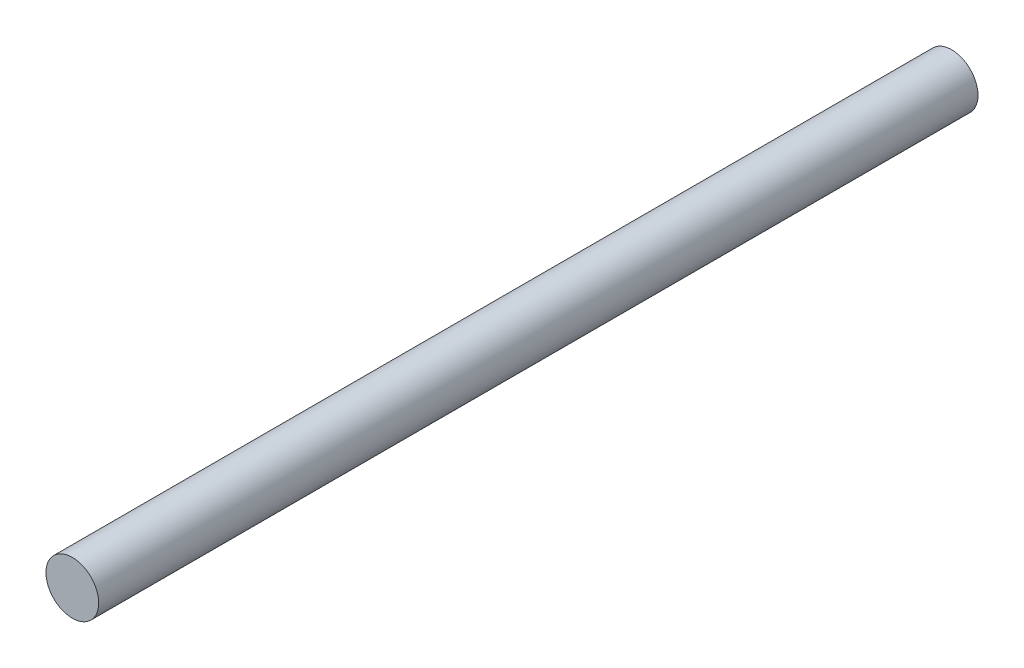
ISO-10303-21;
HEADER;
FILE_DESCRIPTION(('STEP AP214'),'2;1');
FILE_NAME('part.step','',(''),(''),'','','');
FILE_SCHEMA(('AUTOMOTIVE_DESIGN { 1 0 10303 214 1 1 1 1 }'));
ENDSEC;
DATA;
#1=APPLICATION_CONTEXT('core data for automotive mechanical design processes');
#2=APPLICATION_PROTOCOL_DEFINITION('international standard','automotive_design',2000,#1);
#3=PRODUCT_CONTEXT('',#1,'mechanical');
#4=PRODUCT('Part','Part','',(#3));
#5=PRODUCT_RELATED_PRODUCT_CATEGORY('part','',(#4));
#6=PRODUCT_DEFINITION_FORMATION('','',#4);
#7=PRODUCT_DEFINITION_CONTEXT('part definition',#1,'design');
#8=PRODUCT_DEFINITION('design','',#6,#7);
#9=PRODUCT_DEFINITION_SHAPE('','',#8);
#10=(LENGTH_UNIT() NAMED_UNIT(*) SI_UNIT(.MILLI.,.METRE.));
#11=(NAMED_UNIT(*) PLANE_ANGLE_UNIT() SI_UNIT($,.RADIAN.));
#12=(NAMED_UNIT(*) SI_UNIT($,.STERADIAN.) SOLID_ANGLE_UNIT());
#13=UNCERTAINTY_MEASURE_WITH_UNIT(LENGTH_MEASURE(1.E-05),#10,'distance_accuracy_value','');
#14=(GEOMETRIC_REPRESENTATION_CONTEXT(3) GLOBAL_UNCERTAINTY_ASSIGNED_CONTEXT((#13)) GLOBAL_UNIT_ASSIGNED_CONTEXT((#10,
#11,#12)) REPRESENTATION_CONTEXT('',''));
#15=CARTESIAN_POINT('',(0.,0.,0.));
#16=DIRECTION('',(0.,0.,1.));
#17=DIRECTION('',(1.,0.,0.));
#18=AXIS2_PLACEMENT_3D('',#15,#16,#17);
#19=CARTESIAN_POINT('',(0.,0.,5000.));
#20=DIRECTION('',(0.,0.,-1.));
#21=DIRECTION('',(-1.,0.,0.));
#22=AXIS2_PLACEMENT_3D('',#19,#20,#21);
#23=CYLINDRICAL_SURFACE('',#22,150.);
#24=CARTESIAN_POINT('',(0.,0.,5000.));
#25=DIRECTION('',(0.,0.,1.));
#26=DIRECTION('',(1.,0.,0.));
#27=AXIS2_PLACEMENT_3D('',#24,#25,#26);
#28=CIRCLE('',#27,150.);
#29=CARTESIAN_POINT('',(150.,0.,5000.));
#30=VERTEX_POINT('',#29);
#31=EDGE_CURVE('E10',#30,#30,#28,.T.);
#32=ORIENTED_EDGE('',*,*,#31,.F.);
#33=EDGE_LOOP('',(#32));
#34=FACE_BOUND('',#33,.T.);
#35=CARTESIAN_POINT('',(0.,0.,0.));
#36=DIRECTION('',(0.,0.,1.));
#37=DIRECTION('',(1.,0.,0.));
#38=AXIS2_PLACEMENT_3D('',#35,#36,#37);
#39=CIRCLE('',#38,150.);
#40=CARTESIAN_POINT('',(150.,0.,0.));
#41=VERTEX_POINT('',#40);
#42=EDGE_CURVE('E39',#41,#41,#39,.T.);
#43=ORIENTED_EDGE('',*,*,#42,.T.);
#44=EDGE_LOOP('',(#43));
#45=FACE_BOUND('',#44,.T.);
#46=ADVANCED_FACE('F36',(#34,#45),#23,.T.);
#47=CARTESIAN_POINT('',(0.,0.,5000.));
#48=DIRECTION('',(0.,0.,1.));
#49=DIRECTION('',(1.,0.,0.));
#50=AXIS2_PLACEMENT_3D('',#47,#48,#49);
#51=PLANE('',#50);
#52=ORIENTED_EDGE('',*,*,#31,.T.);
#53=EDGE_LOOP('',(#52));
#54=FACE_BOUND('',#53,.T.);
#55=ADVANCED_FACE('F51',(#54),#51,.T.);
#56=CARTESIAN_POINT('',(0.,0.,0.));
#57=DIRECTION('',(0.,0.,1.));
#58=DIRECTION('',(1.,0.,0.));
#59=AXIS2_PLACEMENT_3D('',#56,#57,#58);
#60=PLANE('',#59);
#61=ORIENTED_EDGE('',*,*,#42,.F.);
#62=EDGE_LOOP('',(#61));
#63=FACE_BOUND('',#62,.T.);
#64=ADVANCED_FACE('F49',(#63),#60,.F.);
#65=CLOSED_SHELL('',(#46,#55,#64));
#66=MANIFOLD_SOLID_BREP('B2',#65);
#67=ADVANCED_BREP_SHAPE_REPRESENTATION('',(#18,#66),#14);
#68=SHAPE_DEFINITION_REPRESENTATION(#9,#67);
ENDSEC;
END-ISO-10303-21;
